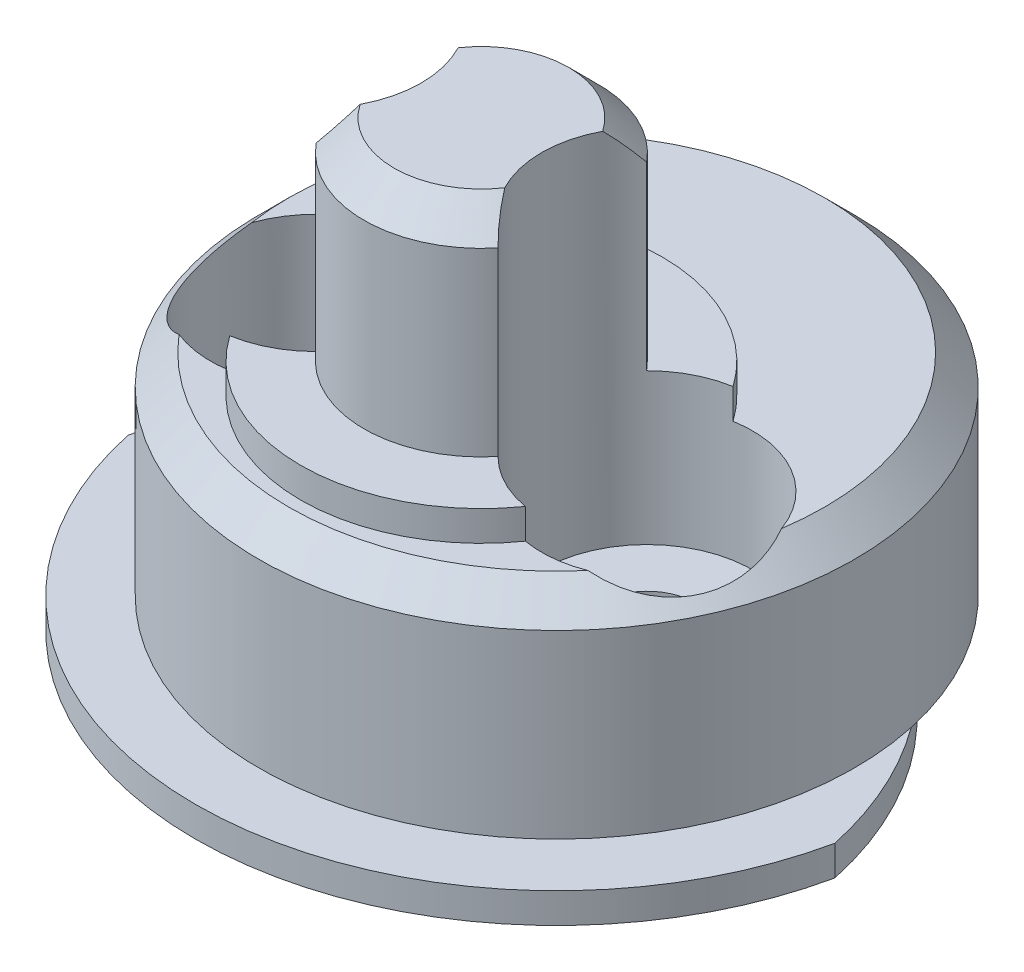
ISO-10303-21;
HEADER;
FILE_DESCRIPTION(('STEP AP214'),'2;1');
FILE_NAME('part.step','',(''),(''),'','','');
FILE_SCHEMA(('AUTOMOTIVE_DESIGN { 1 0 10303 214 1 1 1 1 }'));
ENDSEC;
DATA;
#1=APPLICATION_CONTEXT('core data for automotive mechanical design processes');
#2=APPLICATION_PROTOCOL_DEFINITION('international standard','automotive_design',2000,#1);
#3=PRODUCT_CONTEXT('',#1,'mechanical');
#4=PRODUCT('Part','Part','',(#3));
#5=PRODUCT_RELATED_PRODUCT_CATEGORY('part','',(#4));
#6=PRODUCT_DEFINITION_FORMATION('','',#4);
#7=PRODUCT_DEFINITION_CONTEXT('part definition',#1,'design');
#8=PRODUCT_DEFINITION('design','',#6,#7);
#9=PRODUCT_DEFINITION_SHAPE('','',#8);
#10=(LENGTH_UNIT() NAMED_UNIT(*) SI_UNIT(.MILLI.,.METRE.));
#11=(NAMED_UNIT(*) PLANE_ANGLE_UNIT() SI_UNIT($,.RADIAN.));
#12=(NAMED_UNIT(*) SI_UNIT($,.STERADIAN.) SOLID_ANGLE_UNIT());
#13=UNCERTAINTY_MEASURE_WITH_UNIT(LENGTH_MEASURE(1.E-05),#10,'distance_accuracy_value','');
#14=(GEOMETRIC_REPRESENTATION_CONTEXT(3) GLOBAL_UNCERTAINTY_ASSIGNED_CONTEXT((#13)) GLOBAL_UNIT_ASSIGNED_CONTEXT((#10,
#11,#12)) REPRESENTATION_CONTEXT('',''));
#15=CARTESIAN_POINT('',(0.,0.,0.));
#16=DIRECTION('',(0.,0.,1.));
#17=DIRECTION('',(1.,0.,0.));
#18=AXIS2_PLACEMENT_3D('',#15,#16,#17);
#19=CARTESIAN_POINT('',(0.,-1.,-2.5));
#20=DIRECTION('',(0.,-1.,0.));
#21=DIRECTION('',(0.,0.,-1.));
#22=AXIS2_PLACEMENT_3D('',#19,#20,#21);
#23=PLANE('',#22);
#24=CARTESIAN_POINT('',(5.5,-1.,0.));
#25=DIRECTION('',(0.,-1.,0.));
#26=DIRECTION('',(0.,0.,-1.));
#27=AXIS2_PLACEMENT_3D('',#24,#25,#26);
#28=CIRCLE('',#27,3.5);
#29=CARTESIAN_POINT('',(8.79964011547818,-1.,-1.16720825405201));
#30=VERTEX_POINT('',#29);
#31=CARTESIAN_POINT('',(4.90909090909091,-1.,-3.44975744745641));
#32=VERTEX_POINT('',#31);
#33=EDGE_CURVE('E146',#30,#32,#28,.F.);
#34=ORIENTED_EDGE('',*,*,#33,.F.);
#35=CARTESIAN_POINT('',(0.,-1.,-2.5));
#36=DIRECTION('',(0.,-1.,0.));
#37=DIRECTION('',(0.,0.,-1.));
#38=AXIS2_PLACEMENT_3D('',#35,#36,#37);
#39=CIRCLE('',#38,8.9);
#40=CARTESIAN_POINT('',(-8.79964011547818,-1.,-1.16720825405201));
#41=VERTEX_POINT('',#40);
#42=EDGE_CURVE('E11',#30,#41,#39,.F.);
#43=ORIENTED_EDGE('',*,*,#42,.T.);
#44=CARTESIAN_POINT('',(-5.5,-1.,0.));
#45=DIRECTION('',(0.,-1.,0.));
#46=DIRECTION('',(0.,0.,-1.));
#47=AXIS2_PLACEMENT_3D('',#44,#45,#46);
#48=CIRCLE('',#47,3.5);
#49=CARTESIAN_POINT('',(-4.90909090909091,-1.,-3.44975744745641));
#50=VERTEX_POINT('',#49);
#51=EDGE_CURVE('E172',#50,#41,#48,.F.);
#52=ORIENTED_EDGE('',*,*,#51,.F.);
#53=CARTESIAN_POINT('',(0.,-1.,0.));
#54=DIRECTION('',(0.,-1.,0.));
#55=DIRECTION('',(0.,0.,-1.));
#56=AXIS2_PLACEMENT_3D('',#53,#54,#55);
#57=CIRCLE('',#56,6.);
#58=EDGE_CURVE('E165',#50,#32,#57,.T.);
#59=ORIENTED_EDGE('',*,*,#58,.T.);
#60=EDGE_LOOP('',(#34,#43,#52,#59));
#61=FACE_BOUND('',#60,.T.);
#62=ADVANCED_FACE('F39',(#61),#23,.F.);
#63=CARTESIAN_POINT('',(0.,-1.,0.));
#64=DIRECTION('',(0.,1.,0.));
#65=DIRECTION('',(0.,0.,1.));
#66=AXIS2_PLACEMENT_3D('',#63,#64,#65);
#67=CYLINDRICAL_SURFACE('',#66,6.);
#68=DIRECTION('',(0.,-1.,0.));
#69=VECTOR('',#68,1.);
#70=CARTESIAN_POINT('',(-4.90909090909091,1.,-3.44975744745641));
#71=LINE('',#70,#69);
#72=CARTESIAN_POINT('',(-4.90909090909091,0.,-3.44975744745641));
#73=VERTEX_POINT('',#72);
#74=EDGE_CURVE('E276',#73,#50,#71,.T.);
#75=ORIENTED_EDGE('',*,*,#74,.F.);
#76=CARTESIAN_POINT('',(0.,0.,0.));
#77=DIRECTION('',(0.,-1.,0.));
#78=DIRECTION('',(0.,0.,-1.));
#79=AXIS2_PLACEMENT_3D('',#76,#77,#78);
#80=CIRCLE('',#79,6.);
#81=CARTESIAN_POINT('',(4.90909090909091,0.,-3.44975744745641));
#82=VERTEX_POINT('',#81);
#83=EDGE_CURVE('E167',#73,#82,#80,.T.);
#84=ORIENTED_EDGE('',*,*,#83,.T.);
#85=DIRECTION('',(0.,-1.,0.));
#86=VECTOR('',#85,1.);
#87=CARTESIAN_POINT('',(4.90909090909091,1.,-3.44975744745641));
#88=LINE('',#87,#86);
#89=EDGE_CURVE('E150',#32,#82,#88,.F.);
#90=ORIENTED_EDGE('',*,*,#89,.F.);
#91=ORIENTED_EDGE('',*,*,#58,.F.);
#92=EDGE_LOOP('',(#75,#84,#90,#91));
#93=FACE_BOUND('',#92,.T.);
#94=ADVANCED_FACE('F164',(#93),#67,.T.);
#95=CARTESIAN_POINT('',(0.,7.,0.));
#96=DIRECTION('',(0.,-1.,0.));
#97=DIRECTION('',(0.,0.,-1.));
#98=AXIS2_PLACEMENT_3D('',#95,#96,#97);
#99=CYLINDRICAL_SURFACE('',#98,3.9);
#100=DIRECTION('',(0.,-1.,0.));
#101=VECTOR('',#100,1.);
#102=CARTESIAN_POINT('',(-3.01909090909091,1.,-2.46882362323529));
#103=LINE('',#102,#101);
#104=CARTESIAN_POINT('',(-3.01909090909091,6.,-2.46882362323529));
#105=VERTEX_POINT('',#104);
#106=CARTESIAN_POINT('',(-3.01909090909091,0.,-2.46882362323529));
#107=VERTEX_POINT('',#106);
#108=EDGE_CURVE('E288',#105,#107,#103,.T.);
#109=ORIENTED_EDGE('',*,*,#108,.F.);
#110=CARTESIAN_POINT('',(0.,6.,0.));
#111=DIRECTION('',(0.,1.,0.));
#112=DIRECTION('',(0.,0.,1.));
#113=AXIS2_PLACEMENT_3D('',#110,#111,#112);
#114=CIRCLE('',#113,3.9);
#115=CARTESIAN_POINT('',(3.01909090909091,6.,-2.46882362323529));
#116=VERTEX_POINT('',#115);
#117=EDGE_CURVE('E260',#105,#116,#114,.F.);
#118=ORIENTED_EDGE('',*,*,#117,.T.);
#119=DIRECTION('',(0.,-1.,0.));
#120=VECTOR('',#119,1.);
#121=CARTESIAN_POINT('',(3.01909090909091,1.,-2.46882362323529));
#122=LINE('',#121,#120);
#123=CARTESIAN_POINT('',(3.01909090909091,0.,-2.46882362323529));
#124=VERTEX_POINT('',#123);
#125=EDGE_CURVE('E338',#124,#116,#122,.F.);
#126=ORIENTED_EDGE('',*,*,#125,.F.);
#127=CARTESIAN_POINT('',(0.,0.,0.));
#128=DIRECTION('',(0.,1.,0.));
#129=DIRECTION('',(0.,0.,1.));
#130=AXIS2_PLACEMENT_3D('',#127,#128,#129);
#131=CIRCLE('',#130,3.9);
#132=EDGE_CURVE('E186',#124,#107,#131,.T.);
#133=ORIENTED_EDGE('',*,*,#132,.T.);
#134=EDGE_LOOP('',(#109,#118,#126,#133));
#135=FACE_BOUND('',#134,.T.);
#136=ADVANCED_FACE('F248',(#135),#99,.T.);
#137=DIRECTION('',(0.,-1.,0.));
#138=VECTOR('',#137,1.);
#139=CARTESIAN_POINT('',(3.01909090909091,1.,2.46882362323529));
#140=LINE('',#139,#138);
#141=CARTESIAN_POINT('',(3.01909090909091,6.,2.46882362323529));
#142=VERTEX_POINT('',#141);
#143=CARTESIAN_POINT('',(3.01909090909091,0.,2.46882362323529));
#144=VERTEX_POINT('',#143);
#145=EDGE_CURVE('E342',#142,#144,#140,.T.);
#146=ORIENTED_EDGE('',*,*,#145,.F.);
#147=CARTESIAN_POINT('',(0.,6.,0.));
#148=DIRECTION('',(0.,1.,0.));
#149=DIRECTION('',(0.,0.,1.));
#150=AXIS2_PLACEMENT_3D('',#147,#148,#149);
#151=CIRCLE('',#150,3.9);
#152=CARTESIAN_POINT('',(-3.01909090909091,6.,2.46882362323529));
#153=VERTEX_POINT('',#152);
#154=EDGE_CURVE('E235',#142,#153,#151,.F.);
#155=ORIENTED_EDGE('',*,*,#154,.T.);
#156=DIRECTION('',(0.,-1.,0.));
#157=VECTOR('',#156,1.);
#158=CARTESIAN_POINT('',(-3.01909090909091,1.,2.46882362323529));
#159=LINE('',#158,#157);
#160=CARTESIAN_POINT('',(-3.01909090909091,0.,2.46882362323529));
#161=VERTEX_POINT('',#160);
#162=EDGE_CURVE('E281',#161,#153,#159,.F.);
#163=ORIENTED_EDGE('',*,*,#162,.F.);
#164=EDGE_CURVE('E177',#161,#144,#131,.T.);
#165=ORIENTED_EDGE('',*,*,#164,.T.);
#166=EDGE_LOOP('',(#146,#155,#163,#165));
#167=FACE_BOUND('',#166,.T.);
#168=ADVANCED_FACE('F526',(#167),#99,.T.);
#169=DIRECTION('',(0.,-1.,0.));
#170=VECTOR('',#169,1.);
#171=CARTESIAN_POINT('',(-4.90909090909091,1.,3.44975744745641));
#172=LINE('',#171,#170);
#173=CARTESIAN_POINT('',(-4.90909090909091,-1.,3.44975744745641));
#174=VERTEX_POINT('',#173);
#175=CARTESIAN_POINT('',(-4.90909090909091,0.,3.44975744745641));
#176=VERTEX_POINT('',#175);
#177=EDGE_CURVE('E283',#174,#176,#172,.F.);
#178=ORIENTED_EDGE('',*,*,#177,.F.);
#179=CARTESIAN_POINT('',(4.90909090909091,-1.,3.44975744745641));
#180=VERTEX_POINT('',#179);
#181=EDGE_CURVE('E173',#180,#174,#57,.T.);
#182=ORIENTED_EDGE('',*,*,#181,.F.);
#183=DIRECTION('',(0.,-1.,0.));
#184=VECTOR('',#183,1.);
#185=CARTESIAN_POINT('',(4.90909090909091,1.,3.44975744745641));
#186=LINE('',#185,#184);
#187=CARTESIAN_POINT('',(4.90909090909091,0.,3.44975744745641));
#188=VERTEX_POINT('',#187);
#189=EDGE_CURVE('E193',#188,#180,#186,.T.);
#190=ORIENTED_EDGE('',*,*,#189,.F.);
#191=EDGE_CURVE('E174',#188,#176,#80,.T.);
#192=ORIENTED_EDGE('',*,*,#191,.T.);
#193=EDGE_LOOP('',(#178,#182,#190,#192));
#194=FACE_BOUND('',#193,.T.);
#195=ADVANCED_FACE('F355',(#194),#67,.T.);
#196=CARTESIAN_POINT('',(-5.5,-9.,0.));
#197=DIRECTION('',(0.,1.,0.));
#198=DIRECTION('',(0.,0.,1.));
#199=AXIS2_PLACEMENT_3D('',#196,#197,#198);
#200=CYLINDRICAL_SURFACE('',#199,1.6);
#201=CARTESIAN_POINT('',(-5.5,-9.,0.));
#202=DIRECTION('',(0.,1.,0.));
#203=DIRECTION('',(0.,0.,1.));
#204=AXIS2_PLACEMENT_3D('',#201,#202,#203);
#205=CIRCLE('',#204,1.6);
#206=CARTESIAN_POINT('',(-5.5,-9.,1.6));
#207=VERTEX_POINT('',#206);
#208=EDGE_CURVE('E290',#207,#207,#205,.T.);
#209=ORIENTED_EDGE('',*,*,#208,.F.);
#210=EDGE_LOOP('',(#209));
#211=FACE_BOUND('',#210,.T.);
#212=CARTESIAN_POINT('',(-5.5,-5.,0.));
#213=DIRECTION('',(0.,1.,0.));
#214=DIRECTION('',(0.,0.,1.));
#215=AXIS2_PLACEMENT_3D('',#212,#213,#214);
#216=CIRCLE('',#215,1.6);
#217=CARTESIAN_POINT('',(-5.5,-5.,1.6));
#218=VERTEX_POINT('',#217);
#219=EDGE_CURVE('E190',#218,#218,#216,.F.);
#220=ORIENTED_EDGE('',*,*,#219,.F.);
#221=EDGE_LOOP('',(#220));
#222=FACE_BOUND('',#221,.T.);
#223=ADVANCED_FACE('F405',(#211,#222),#200,.F.);
#224=CARTESIAN_POINT('',(5.5,-9.,0.));
#225=DIRECTION('',(0.,1.,0.));
#226=DIRECTION('',(0.,0.,1.));
#227=AXIS2_PLACEMENT_3D('',#224,#225,#226);
#228=CYLINDRICAL_SURFACE('',#227,1.6);
#229=CARTESIAN_POINT('',(5.5,-9.,0.));
#230=DIRECTION('',(0.,1.,0.));
#231=DIRECTION('',(0.,0.,1.));
#232=AXIS2_PLACEMENT_3D('',#229,#230,#231);
#233=CIRCLE('',#232,1.6);
#234=CARTESIAN_POINT('',(5.5,-9.,1.6));
#235=VERTEX_POINT('',#234);
#236=EDGE_CURVE('E291',#235,#235,#233,.T.);
#237=ORIENTED_EDGE('',*,*,#236,.F.);
#238=EDGE_LOOP('',(#237));
#239=FACE_BOUND('',#238,.T.);
#240=CARTESIAN_POINT('',(5.5,-5.,0.));
#241=DIRECTION('',(0.,1.,0.));
#242=DIRECTION('',(0.,0.,1.));
#243=AXIS2_PLACEMENT_3D('',#240,#241,#242);
#244=CIRCLE('',#243,1.6);
#245=CARTESIAN_POINT('',(5.5,-5.,1.6));
#246=VERTEX_POINT('',#245);
#247=EDGE_CURVE('E187',#246,#246,#244,.F.);
#248=ORIENTED_EDGE('',*,*,#247,.F.);
#249=EDGE_LOOP('',(#248));
#250=FACE_BOUND('',#249,.T.);
#251=ADVANCED_FACE('F407',(#239,#250),#228,.F.);
#252=CARTESIAN_POINT('',(0.,0.,0.));
#253=DIRECTION('',(0.,-1.,0.));
#254=DIRECTION('',(0.,0.,-1.));
#255=AXIS2_PLACEMENT_3D('',#252,#253,#254);
#256=PLANE('',#255);
#257=CARTESIAN_POINT('',(-5.5,0.,0.));
#258=DIRECTION('',(0.,-1.,0.));
#259=DIRECTION('',(0.,0.,-1.));
#260=AXIS2_PLACEMENT_3D('',#257,#258,#259);
#261=CIRCLE('',#260,3.5);
#262=EDGE_CURVE('E279',#176,#161,#261,.F.);
#263=ORIENTED_EDGE('',*,*,#262,.F.);
#264=ORIENTED_EDGE('',*,*,#191,.F.);
#265=CARTESIAN_POINT('',(5.5,0.,0.));
#266=DIRECTION('',(0.,-1.,0.));
#267=DIRECTION('',(0.,0.,-1.));
#268=AXIS2_PLACEMENT_3D('',#265,#266,#267);
#269=CIRCLE('',#268,3.5);
#270=EDGE_CURVE('E169',#144,#188,#269,.F.);
#271=ORIENTED_EDGE('',*,*,#270,.F.);
#272=ORIENTED_EDGE('',*,*,#164,.F.);
#273=EDGE_LOOP('',(#263,#264,#271,#272));
#274=FACE_BOUND('',#273,.T.);
#275=ADVANCED_FACE('F353',(#274),#256,.F.);
#276=CARTESIAN_POINT('',(0.,7.,0.));
#277=DIRECTION('',(0.,1.,0.));
#278=DIRECTION('',(0.,0.,1.));
#279=AXIS2_PLACEMENT_3D('',#276,#277,#278);
#280=PLANE('',#279);
#281=CARTESIAN_POINT('',(-5.5,7.,0.));
#282=DIRECTION('',(0.,1.,0.));
#283=DIRECTION('',(0.,0.,1.));
#284=AXIS2_PLACEMENT_3D('',#281,#282,#283);
#285=CIRCLE('',#284,3.5);
#286=CARTESIAN_POINT('',(-2.40090909090909,7.,1.62654097310522));
#287=VERTEX_POINT('',#286);
#288=CARTESIAN_POINT('',(-2.40090909090909,7.,-1.62654097310522));
#289=VERTEX_POINT('',#288);
#290=EDGE_CURVE('E191',#287,#289,#285,.T.);
#291=ORIENTED_EDGE('',*,*,#290,.F.);
#292=CARTESIAN_POINT('',(0.,7.,0.));
#293=DIRECTION('',(0.,1.,0.));
#294=DIRECTION('',(0.,0.,1.));
#295=AXIS2_PLACEMENT_3D('',#292,#293,#294);
#296=CIRCLE('',#295,2.9);
#297=CARTESIAN_POINT('',(2.40090909090909,7.,1.62654097310522));
#298=VERTEX_POINT('',#297);
#299=EDGE_CURVE('E200',#287,#298,#296,.T.);
#300=ORIENTED_EDGE('',*,*,#299,.T.);
#301=CARTESIAN_POINT('',(5.5,7.,0.));
#302=DIRECTION('',(0.,1.,0.));
#303=DIRECTION('',(0.,0.,1.));
#304=AXIS2_PLACEMENT_3D('',#301,#302,#303);
#305=CIRCLE('',#304,3.5);
#306=CARTESIAN_POINT('',(2.40090909090909,7.,-1.62654097310522));
#307=VERTEX_POINT('',#306);
#308=EDGE_CURVE('E362',#307,#298,#305,.T.);
#309=ORIENTED_EDGE('',*,*,#308,.F.);
#310=CARTESIAN_POINT('',(0.,7.,0.));
#311=DIRECTION('',(0.,1.,0.));
#312=DIRECTION('',(0.,0.,1.));
#313=AXIS2_PLACEMENT_3D('',#310,#311,#312);
#314=CIRCLE('',#313,2.9);
#315=EDGE_CURVE('E197',#307,#289,#314,.T.);
#316=ORIENTED_EDGE('',*,*,#315,.T.);
#317=EDGE_LOOP('',(#291,#300,#309,#316));
#318=FACE_BOUND('',#317,.T.);
#319=ADVANCED_FACE('F414',(#318),#280,.T.);
#320=CARTESIAN_POINT('',(-5.5,0.,0.));
#321=DIRECTION('',(0.,-1.,0.));
#322=DIRECTION('',(0.,0.,-1.));
#323=AXIS2_PLACEMENT_3D('',#320,#321,#322);
#324=CIRCLE('',#323,3.5);
#325=EDGE_CURVE('E278',#107,#73,#324,.F.);
#326=ORIENTED_EDGE('',*,*,#325,.F.);
#327=ORIENTED_EDGE('',*,*,#132,.F.);
#328=CARTESIAN_POINT('',(5.5,0.,0.));
#329=DIRECTION('',(0.,-1.,0.));
#330=DIRECTION('',(0.,0.,-1.));
#331=AXIS2_PLACEMENT_3D('',#328,#329,#330);
#332=CIRCLE('',#331,3.5);
#333=EDGE_CURVE('E168',#82,#124,#332,.F.);
#334=ORIENTED_EDGE('',*,*,#333,.F.);
#335=ORIENTED_EDGE('',*,*,#83,.F.);
#336=EDGE_LOOP('',(#326,#327,#334,#335));
#337=FACE_BOUND('',#336,.T.);
#338=ADVANCED_FACE('F340',(#337),#256,.F.);
#339=CARTESIAN_POINT('',(0.,-8.,-2.5));
#340=DIRECTION('',(0.,1.,0.));
#341=DIRECTION('',(0.,0.,1.));
#342=AXIS2_PLACEMENT_3D('',#339,#340,#341);
#343=CYLINDRICAL_SURFACE('',#342,9.9);
#344=CARTESIAN_POINT('',(0.,-2.,-2.5));
#345=DIRECTION('',(0.,-1.,0.));
#346=DIRECTION('',(0.,0.,-1.));
#347=AXIS2_PLACEMENT_3D('',#344,#345,#346);
#348=CIRCLE('',#347,9.9);
#349=CARTESIAN_POINT('',(0.,-2.,-12.4));
#350=VERTEX_POINT('',#349);
#351=EDGE_CURVE('E267',#350,#350,#348,.T.);
#352=ORIENTED_EDGE('',*,*,#351,.T.);
#353=EDGE_LOOP('',(#352));
#354=FACE_BOUND('',#353,.T.);
#355=CARTESIAN_POINT('',(0.,-8.,-2.5));
#356=DIRECTION('',(0.,-1.,0.));
#357=DIRECTION('',(0.,0.,-1.));
#358=AXIS2_PLACEMENT_3D('',#355,#356,#357);
#359=CIRCLE('',#358,9.9);
#360=CARTESIAN_POINT('',(9.67492630462889,-8.,-4.599));
#361=VERTEX_POINT('',#360);
#362=CARTESIAN_POINT('',(-9.67492630462889,-8.,-4.599));
#363=VERTEX_POINT('',#362);
#364=EDGE_CURVE('E181',#361,#363,#359,.T.);
#365=ORIENTED_EDGE('',*,*,#364,.F.);
#366=EDGE_CURVE('E311',#363,#361,#359,.T.);
#367=ORIENTED_EDGE('',*,*,#366,.F.);
#368=EDGE_LOOP('',(#365,#367));
#369=FACE_BOUND('',#368,.T.);
#370=ADVANCED_FACE('F392',(#354,#369),#343,.T.);
#371=CARTESIAN_POINT('',(0.,-8.,-2.5));
#372=DIRECTION('',(0.,-1.,0.));
#373=DIRECTION('',(0.,0.,-1.));
#374=AXIS2_PLACEMENT_3D('',#371,#372,#373);
#375=PLANE('',#374);
#376=CARTESIAN_POINT('',(0.,-8.,2.5));
#377=DIRECTION('',(0.,-1.,0.));
#378=DIRECTION('',(0.,0.,-1.));
#379=AXIS2_PLACEMENT_3D('',#376,#377,#378);
#380=CIRCLE('',#379,12.);
#381=EDGE_CURVE('E158',#363,#361,#380,.T.);
#382=ORIENTED_EDGE('',*,*,#381,.F.);
#383=ORIENTED_EDGE('',*,*,#366,.T.);
#384=EDGE_LOOP('',(#382,#383));
#385=FACE_BOUND('',#384,.T.);
#386=ADVANCED_FACE('F386',(#385),#375,.T.);
#387=CARTESIAN_POINT('',(-6.79022289822044,-1.,3.25350962391502));
#388=VERTEX_POINT('',#387);
#389=EDGE_CURVE('E195',#388,#174,#48,.F.);
#390=ORIENTED_EDGE('',*,*,#389,.F.);
#391=CARTESIAN_POINT('',(0.,-1.,-2.5));
#392=DIRECTION('',(0.,-1.,0.));
#393=DIRECTION('',(0.,0.,-1.));
#394=AXIS2_PLACEMENT_3D('',#391,#392,#393);
#395=CIRCLE('',#394,8.9);
#396=CARTESIAN_POINT('',(6.79022289822044,-1.,3.25350962391502));
#397=VERTEX_POINT('',#396);
#398=EDGE_CURVE('E49',#388,#397,#395,.F.);
#399=ORIENTED_EDGE('',*,*,#398,.T.);
#400=EDGE_CURVE('E157',#180,#397,#28,.F.);
#401=ORIENTED_EDGE('',*,*,#400,.F.);
#402=ORIENTED_EDGE('',*,*,#181,.T.);
#403=EDGE_LOOP('',(#390,#399,#401,#402));
#404=FACE_BOUND('',#403,.T.);
#405=ADVANCED_FACE('F271',(#404),#23,.F.);
#406=CARTESIAN_POINT('',(0.,-8.,0.));
#407=DIRECTION('',(0.,-1.,0.));
#408=DIRECTION('',(0.,0.,-1.));
#409=AXIS2_PLACEMENT_3D('',#406,#407,#408);
#410=PLANE('',#409);
#411=CARTESIAN_POINT('',(11.7366945943055,-8.,0.));
#412=VERTEX_POINT('',#411);
#413=EDGE_CURVE('E294',#361,#412,#380,.T.);
#414=ORIENTED_EDGE('',*,*,#413,.F.);
#415=ORIENTED_EDGE('',*,*,#364,.T.);
#416=CARTESIAN_POINT('',(-11.7366945943055,-8.,0.));
#417=VERTEX_POINT('',#416);
#418=EDGE_CURVE('E304',#417,#363,#380,.T.);
#419=ORIENTED_EDGE('',*,*,#418,.F.);
#420=CARTESIAN_POINT('',(0.,-8.,-2.5));
#421=DIRECTION('',(0.,-1.,0.));
#422=DIRECTION('',(0.,0.,-1.));
#423=AXIS2_PLACEMENT_3D('',#420,#421,#422);
#424=CIRCLE('',#423,12.);
#425=EDGE_CURVE('E301',#412,#417,#424,.T.);
#426=ORIENTED_EDGE('',*,*,#425,.F.);
#427=EDGE_LOOP('',(#414,#415,#419,#426));
#428=FACE_BOUND('',#427,.T.);
#429=ADVANCED_FACE('F321',(#428),#410,.F.);
#430=CARTESIAN_POINT('',(0.,-9.,2.5));
#431=DIRECTION('',(0.,1.,0.));
#432=DIRECTION('',(0.,0.,1.));
#433=AXIS2_PLACEMENT_3D('',#430,#431,#432);
#434=CYLINDRICAL_SURFACE('',#433,12.);
#435=ORIENTED_EDGE('',*,*,#418,.T.);
#436=ORIENTED_EDGE('',*,*,#381,.T.);
#437=ORIENTED_EDGE('',*,*,#413,.T.);
#438=DIRECTION('',(0.,1.,0.));
#439=VECTOR('',#438,1.);
#440=CARTESIAN_POINT('',(11.7366945943055,-9.,0.));
#441=LINE('',#440,#439);
#442=CARTESIAN_POINT('',(11.7366945943055,-9.,0.));
#443=VERTEX_POINT('',#442);
#444=EDGE_CURVE('E309',#443,#412,#441,.T.);
#445=ORIENTED_EDGE('',*,*,#444,.F.);
#446=CARTESIAN_POINT('',(0.,-9.,2.5));
#447=DIRECTION('',(0.,-1.,0.));
#448=DIRECTION('',(0.,0.,-1.));
#449=AXIS2_PLACEMENT_3D('',#446,#447,#448);
#450=CIRCLE('',#449,12.);
#451=CARTESIAN_POINT('',(-11.7366945943055,-9.,0.));
#452=VERTEX_POINT('',#451);
#453=EDGE_CURVE('E297',#452,#443,#450,.T.);
#454=ORIENTED_EDGE('',*,*,#453,.F.);
#455=DIRECTION('',(0.,1.,0.));
#456=VECTOR('',#455,1.);
#457=CARTESIAN_POINT('',(-11.7366945943055,-9.,0.));
#458=LINE('',#457,#456);
#459=EDGE_CURVE('E303',#452,#417,#458,.T.);
#460=ORIENTED_EDGE('',*,*,#459,.T.);
#461=EDGE_LOOP('',(#435,#436,#437,#445,#454,#460));
#462=FACE_BOUND('',#461,.T.);
#463=ADVANCED_FACE('F326',(#462),#434,.T.);
#464=CARTESIAN_POINT('',(0.,-9.,-2.5));
#465=DIRECTION('',(0.,1.,0.));
#466=DIRECTION('',(0.,0.,1.));
#467=AXIS2_PLACEMENT_3D('',#464,#465,#466);
#468=CYLINDRICAL_SURFACE('',#467,12.);
#469=ORIENTED_EDGE('',*,*,#425,.T.);
#470=ORIENTED_EDGE('',*,*,#459,.F.);
#471=CARTESIAN_POINT('',(0.,-9.,-2.5));
#472=DIRECTION('',(0.,-1.,0.));
#473=DIRECTION('',(0.,0.,-1.));
#474=AXIS2_PLACEMENT_3D('',#471,#472,#473);
#475=CIRCLE('',#474,12.);
#476=EDGE_CURVE('E300',#443,#452,#475,.T.);
#477=ORIENTED_EDGE('',*,*,#476,.F.);
#478=ORIENTED_EDGE('',*,*,#444,.T.);
#479=EDGE_LOOP('',(#469,#470,#477,#478));
#480=FACE_BOUND('',#479,.T.);
#481=ADVANCED_FACE('F329',(#480),#468,.T.);
#482=CARTESIAN_POINT('',(0.,-9.,0.));
#483=DIRECTION('',(0.,-1.,0.));
#484=DIRECTION('',(0.,0.,-1.));
#485=AXIS2_PLACEMENT_3D('',#482,#483,#484);
#486=PLANE('',#485);
#487=ORIENTED_EDGE('',*,*,#236,.T.);
#488=EDGE_LOOP('',(#487));
#489=FACE_BOUND('',#488,.T.);
#490=ORIENTED_EDGE('',*,*,#208,.T.);
#491=EDGE_LOOP('',(#490));
#492=FACE_BOUND('',#491,.T.);
#493=ORIENTED_EDGE('',*,*,#453,.T.);
#494=ORIENTED_EDGE('',*,*,#476,.T.);
#495=EDGE_LOOP('',(#493,#494));
#496=FACE_BOUND('',#495,.T.);
#497=ADVANCED_FACE('F220',(#489,#492,#496),#486,.T.);
#498=CARTESIAN_POINT('',(5.5,7.,0.));
#499=DIRECTION('',(0.,-1.,0.));
#500=DIRECTION('',(0.,0.,-1.));
#501=AXIS2_PLACEMENT_3D('',#498,#499,#500);
#502=CYLINDRICAL_SURFACE('',#501,3.5);
#503=CARTESIAN_POINT('',(5.5,-5.,0.));
#504=DIRECTION('',(0.,1.,0.));
#505=DIRECTION('',(0.,0.,1.));
#506=AXIS2_PLACEMENT_3D('',#503,#504,#505);
#507=CIRCLE('',#506,3.5);
#508=CARTESIAN_POINT('',(5.5,-5.,3.5));
#509=VERTEX_POINT('',#508);
#510=EDGE_CURVE('E358',#509,#509,#507,.T.);
#511=ORIENTED_EDGE('',*,*,#510,.F.);
#512=EDGE_LOOP('',(#511));
#513=FACE_BOUND('',#512,.T.);
#514=ORIENTED_EDGE('',*,*,#308,.T.);
#515=CARTESIAN_POINT('',(2.40090909090909,7.,1.62654097310523));
#516=CARTESIAN_POINT('',(2.42199990388801,6.95999725035649,1.66672069154054));
#517=CARTESIAN_POINT('',(2.44371788101233,6.9196387331948,1.70620680259726));
#518=CARTESIAN_POINT('',(2.48837645371307,6.83833550017322,1.78385348886781));
#519=CARTESIAN_POINT('',(2.51131692743927,6.79739084303224,1.82201419556508));
#520=CARTESIAN_POINT('',(2.58178012938787,6.67411755196546,1.93437187306167));
#521=CARTESIAN_POINT('',(2.63108023452129,6.59109161468316,2.0067010878354));
#522=CARTESIAN_POINT('',(2.73420776146176,6.42390021197347,2.14661332732124));
#523=CARTESIAN_POINT('',(2.78803472806847,6.33973486183259,2.21419682798942));
#524=CARTESIAN_POINT('',(2.90022605056246,6.17042718120971,2.34490684909427));
#525=CARTESIAN_POINT('',(2.95860411664017,6.08528261354037,2.40801871582163));
#526=CARTESIAN_POINT('',(3.01909090909091,6.00000000000001,2.4688236232353));
#527=B_SPLINE_CURVE_WITH_KNOTS('',3,(#515,#516,#517,#518,#519,#520,#521,#522,#523,#524,#525,
#526),.UNSPECIFIED.,.F.,.F.,(4,2,2,2,2,4),(0.,0.181460361517043,0.362902669994912,
0.724624119957299,1.08630924026815,1.44912949206952),.UNSPECIFIED.);
#528=EDGE_CURVE('E228',#298,#142,#527,.T.);
#529=ORIENTED_EDGE('',*,*,#528,.T.);
#530=ORIENTED_EDGE('',*,*,#145,.T.);
#531=ORIENTED_EDGE('',*,*,#270,.T.);
#532=ORIENTED_EDGE('',*,*,#189,.T.);
#533=ORIENTED_EDGE('',*,*,#400,.T.);
#534=CARTESIAN_POINT('',(6.79022289822044,-1.,3.25350962391502));
#535=CARTESIAN_POINT('',(6.86966342894281,-1.0402457586237,3.22201362429472));
#536=CARTESIAN_POINT('',(6.94861048957112,-1.07901752787151,3.18733136238277));
#537=CARTESIAN_POINT('',(7.10496625843925,-1.15337869777628,3.11153115674559));
#538=CARTESIAN_POINT('',(7.18237395939578,-1.18896606476426,3.07040914582352));
#539=CARTESIAN_POINT('',(7.33532230518292,-1.25681651115793,2.98151724979297));
#540=CARTESIAN_POINT('',(7.41085359490683,-1.28906478803481,2.9337197992728));
#541=CARTESIAN_POINT('',(7.55899848002116,-1.34978346570966,2.83171812834672));
#542=CARTESIAN_POINT('',(7.63161264729381,-1.37825460953385,2.77751517199114));
#543=CARTESIAN_POINT('',(7.84465856933906,-1.45783146961186,2.60498621688847));
#544=CARTESIAN_POINT('',(7.97980281129003,-1.50288318505745,2.47702147406228));
#545=CARTESIAN_POINT('',(8.22965883278394,-1.5747344949486,2.19860784449164));
#546=CARTESIAN_POINT('',(8.34441627865589,-1.60157527228201,2.04821063405966));
#547=CARTESIAN_POINT('',(8.54064862013234,-1.63455497771984,1.74207180300463));
#548=CARTESIAN_POINT('',(8.62405609649435,-1.64218314656135,1.58772903047237));
#549=CARTESIAN_POINT('',(8.76680450402185,-1.64077316769958,1.26829981743287));
#550=CARTESIAN_POINT('',(8.82613998706493,-1.63173124968365,1.10321095460411));
#551=CARTESIAN_POINT('',(8.91701498192721,-1.59817962397532,0.77559873195805));
#552=CARTESIAN_POINT('',(8.94973412093945,-1.57442002762373,0.613321982418135));
#553=CARTESIAN_POINT('',(8.99194471529335,-1.51298614950457,0.288395788306735));
#554=CARTESIAN_POINT('',(9.00143083389243,-1.4753086730163,0.12574626669417));
#555=CARTESIAN_POINT('',(8.99815321370098,-1.38547486205018,-0.202347242629634));
#556=CARTESIAN_POINT('',(8.98446609944584,-1.33279061346917,-0.367634587070396));
#557=CARTESIAN_POINT('',(8.93514097699868,-1.21531273920601,-0.690211317736818));
#558=CARTESIAN_POINT('',(8.8995244334156,-1.15053099774168,-0.847508362124047));
#559=CARTESIAN_POINT('',(8.83738935793464,-1.05440852715114,-1.0561078163307));
#560=CARTESIAN_POINT('',(8.81915086097426,-1.02754447445046,-1.1120754830298));
#561=CARTESIAN_POINT('',(8.79964011547818,-1.,-1.16720825405201));
#562=B_SPLINE_CURVE_WITH_KNOTS('',3,(#534,#535,#536,#537,#538,#539,#540,#541,#542,#543,#544,
#545,#546,#547,#548,#549,#550,#551,#552,#553,#554,#555,#556,#557,#558,#559,#560,#561),
.UNSPECIFIED.,.F.,.F.,(4,2,2,2,2,2,2,2,2,2,2,2,2,4),(0.,0.283338258744689,0.56685619452006,
0.851581544540817,1.13625080093406,1.70738405036864,2.27722137416255,2.8013023603098,
3.32550189362439,3.82496281507743,4.3245384544807,4.84449223009244,5.36393788025238,
5.55794548312024),.UNSPECIFIED.);
#563=EDGE_CURVE('E154',#397,#30,#562,.T.);
#564=ORIENTED_EDGE('',*,*,#563,.T.);
#565=ORIENTED_EDGE('',*,*,#33,.T.);
#566=ORIENTED_EDGE('',*,*,#89,.T.);
#567=ORIENTED_EDGE('',*,*,#333,.T.);
#568=ORIENTED_EDGE('',*,*,#125,.T.);
#569=CARTESIAN_POINT('',(3.01909090909091,6.,-2.46882362323529));
#570=CARTESIAN_POINT('',(2.95860411664017,6.08528261354037,-2.40801871582163));
#571=CARTESIAN_POINT('',(2.90022605056247,6.17042718120971,-2.34490684909428));
#572=CARTESIAN_POINT('',(2.78803472806847,6.33973486183258,-2.21419682798942));
#573=CARTESIAN_POINT('',(2.73420776146176,6.42390021197346,-2.14661332732124));
#574=CARTESIAN_POINT('',(2.6310802345213,6.59109161468316,-2.00670108783541));
#575=CARTESIAN_POINT('',(2.58178012938787,6.67411755196547,-1.93437187306168));
#576=CARTESIAN_POINT('',(2.51131692743927,6.79739084303223,-1.82201419556509));
#577=CARTESIAN_POINT('',(2.48837645371307,6.8383355001732,-1.78385348886781));
#578=CARTESIAN_POINT('',(2.44371788101233,6.9196387331948,-1.70620680259728));
#579=CARTESIAN_POINT('',(2.42199990388802,6.95999725035652,-1.66672069154059));
#580=CARTESIAN_POINT('',(2.4009090909091,7.0000000000001,-1.62654097310535));
#581=B_SPLINE_CURVE_WITH_KNOTS('',3,(#569,#570,#571,#572,#573,#574,#575,#576,#577,#578,#579,
#580),.UNSPECIFIED.,.F.,.F.,(4,2,2,2,2,4),(0.,0.362820251801365,0.724505372112218,
1.0862268220746,1.26766913055246,1.4491294920695),.UNSPECIFIED.);
#582=EDGE_CURVE('E209',#116,#307,#581,.T.);
#583=ORIENTED_EDGE('',*,*,#582,.T.);
#584=EDGE_LOOP('',(#514,#529,#530,#531,#532,#533,#564,#565,#566,#567,#568,#583));
#585=FACE_BOUND('',#584,.T.);
#586=ADVANCED_FACE('F149',(#513,#585),#502,.F.);
#587=CARTESIAN_POINT('',(5.5,-5.,0.));
#588=DIRECTION('',(0.,1.,0.));
#589=DIRECTION('',(0.,0.,1.));
#590=AXIS2_PLACEMENT_3D('',#587,#588,#589);
#591=PLANE('',#590);
#592=ORIENTED_EDGE('',*,*,#510,.T.);
#593=EDGE_LOOP('',(#592));
#594=FACE_BOUND('',#593,.T.);
#595=ORIENTED_EDGE('',*,*,#247,.T.);
#596=EDGE_LOOP('',(#595));
#597=FACE_BOUND('',#596,.T.);
#598=ADVANCED_FACE('F219',(#594,#597),#591,.T.);
#599=CARTESIAN_POINT('',(-5.5,7.,0.));
#600=DIRECTION('',(0.,-1.,0.));
#601=DIRECTION('',(0.,0.,-1.));
#602=AXIS2_PLACEMENT_3D('',#599,#600,#601);
#603=CYLINDRICAL_SURFACE('',#602,3.5);
#604=CARTESIAN_POINT('',(-5.5,-5.,0.));
#605=DIRECTION('',(0.,1.,0.));
#606=DIRECTION('',(0.,0.,1.));
#607=AXIS2_PLACEMENT_3D('',#604,#605,#606);
#608=CIRCLE('',#607,3.5);
#609=CARTESIAN_POINT('',(-5.5,-5.,3.5));
#610=VERTEX_POINT('',#609);
#611=EDGE_CURVE('E361',#610,#610,#608,.T.);
#612=ORIENTED_EDGE('',*,*,#611,.F.);
#613=EDGE_LOOP('',(#612));
#614=FACE_BOUND('',#613,.T.);
#615=ORIENTED_EDGE('',*,*,#162,.T.);
#616=CARTESIAN_POINT('',(-3.01909090909091,6.,2.46882362323529));
#617=CARTESIAN_POINT('',(-2.95860411664017,6.08528261354037,2.40801871582163));
#618=CARTESIAN_POINT('',(-2.90022605056247,6.17042718120971,2.34490684909428));
#619=CARTESIAN_POINT('',(-2.78803472806847,6.33973486183258,2.21419682798942));
#620=CARTESIAN_POINT('',(-2.73420776146176,6.42390021197346,2.14661332732124));
#621=CARTESIAN_POINT('',(-2.6310802345213,6.59109161468316,2.00670108783541));
#622=CARTESIAN_POINT('',(-2.58178012938787,6.67411755196547,1.93437187306168));
#623=CARTESIAN_POINT('',(-2.51131692743927,6.79739084303223,1.82201419556509));
#624=CARTESIAN_POINT('',(-2.48837645371307,6.8383355001732,1.78385348886781));
#625=CARTESIAN_POINT('',(-2.44371788101233,6.9196387331948,1.70620680259728));
#626=CARTESIAN_POINT('',(-2.42199990388802,6.95999725035652,1.66672069154059));
#627=CARTESIAN_POINT('',(-2.4009090909091,7.0000000000001,1.62654097310535));
#628=B_SPLINE_CURVE_WITH_KNOTS('',3,(#616,#617,#618,#619,#620,#621,#622,#623,#624,#625,#626,
#627),.UNSPECIFIED.,.F.,.F.,(4,2,2,2,2,4),(0.,0.362820251801365,0.724505372112218,
1.0862268220746,1.26766913055246,1.4491294920695),.UNSPECIFIED.);
#629=EDGE_CURVE('E253',#153,#287,#628,.T.);
#630=ORIENTED_EDGE('',*,*,#629,.T.);
#631=ORIENTED_EDGE('',*,*,#290,.T.);
#632=CARTESIAN_POINT('',(-2.40090909090909,7.,-1.62654097310523));
#633=CARTESIAN_POINT('',(-2.42199990388801,6.95999725035649,-1.66672069154054));
#634=CARTESIAN_POINT('',(-2.44371788101233,6.9196387331948,-1.70620680259726));
#635=CARTESIAN_POINT('',(-2.48837645371307,6.83833550017322,-1.78385348886781));
#636=CARTESIAN_POINT('',(-2.51131692743927,6.79739084303224,-1.82201419556508));
#637=CARTESIAN_POINT('',(-2.58178012938787,6.67411755196546,-1.93437187306167));
#638=CARTESIAN_POINT('',(-2.63108023452129,6.59109161468316,-2.0067010878354));
#639=CARTESIAN_POINT('',(-2.73420776146176,6.42390021197347,-2.14661332732124));
#640=CARTESIAN_POINT('',(-2.78803472806847,6.33973486183259,-2.21419682798942));
#641=CARTESIAN_POINT('',(-2.90022605056246,6.17042718120971,-2.34490684909427));
#642=CARTESIAN_POINT('',(-2.95860411664017,6.08528261354037,-2.40801871582163));
#643=CARTESIAN_POINT('',(-3.01909090909091,6.00000000000001,-2.4688236232353));
#644=B_SPLINE_CURVE_WITH_KNOTS('',3,(#632,#633,#634,#635,#636,#637,#638,#639,#640,#641,#642,
#643),.UNSPECIFIED.,.F.,.F.,(4,2,2,2,2,4),(0.,0.181460361517043,0.362902669994912,
0.724624119957299,1.08630924026815,1.44912949206952),.UNSPECIFIED.);
#645=EDGE_CURVE('E261',#289,#105,#644,.T.);
#646=ORIENTED_EDGE('',*,*,#645,.T.);
#647=ORIENTED_EDGE('',*,*,#108,.T.);
#648=ORIENTED_EDGE('',*,*,#325,.T.);
#649=ORIENTED_EDGE('',*,*,#74,.T.);
#650=ORIENTED_EDGE('',*,*,#51,.T.);
#651=CARTESIAN_POINT('',(-8.79964011547818,-1.,-1.16720825405201));
#652=CARTESIAN_POINT('',(-8.82814512226664,-1.0402457586237,-1.0866461010177));
#653=CARTESIAN_POINT('',(-8.85392504699268,-1.07901752787151,-1.00436066394468));
#654=CARTESIAN_POINT('',(-8.89962457569987,-1.15337869777628,-0.836717141227803));
#655=CARTESIAN_POINT('',(-8.91954045303138,-1.18896606476426,-0.75135714017481));
#656=CARTESIAN_POINT('',(-8.95313588201909,-1.25681651115793,-0.577672619246603));
#657=CARTESIAN_POINT('',(-8.96678851391139,-1.28906478803481,-0.489337022537246));
#658=CARTESIAN_POINT('',(-8.98734827534363,-1.34978346570966,-0.310651421362719));
#659=CARTESIAN_POINT('',(-8.99425673328241,-1.37825460953385,-0.220301817183765));
#660=CARTESIAN_POINT('',(-9.0043541542074,-1.45783146961186,0.0536559301781058));
#661=CARTESIAN_POINT('',(-8.99680432897736,-1.50288318505745,0.239618135150169));
#662=CARTESIAN_POINT('',(-8.95132952631053,-1.5747344949486,0.610932318733125));
#663=CARTESIAN_POINT('',(-8.91347351025704,-1.60157527228201,0.796284724537127));
#664=CARTESIAN_POINT('',(-8.81185045111791,-1.63455497771984,1.14542777483639));
#665=CARTESIAN_POINT('',(-8.75040807270835,-1.64218314656135,1.30975468280158));
#666=CARTESIAN_POINT('',(-8.60360419386105,-1.64077316769958,1.62734049978663));
#667=CARTESIAN_POINT('',(-8.51823728605949,-1.63173124968365,1.78059689681608));
#668=CARTESIAN_POINT('',(-8.33115958068766,-1.59817962397532,2.06448061468507));
#669=CARTESIAN_POINT('',(-8.23041023065878,-1.57442002762373,2.1958345410356));
#670=CARTESIAN_POINT('',(-8.01335773549248,-1.51298614950457,2.44128714386864));
#671=CARTESIAN_POINT('',(-7.8970510232194,-1.4753086730163,2.55538185017484));
#672=CARTESIAN_POINT('',(-7.64770213579476,-1.38547486205018,2.76864512876406));
#673=CARTESIAN_POINT('',(-7.51417082855518,-1.33279061346917,2.86701500888904));
#674=CARTESIAN_POINT('',(-7.23870060849879,-1.21531273920601,3.04195749296294));
#675=CARTESIAN_POINT('',(-7.09677003954968,-1.15053099774168,3.11855130438099));
#676=CARTESIAN_POINT('',(-6.89875012715992,-1.05440852715114,3.20889849137368));
#677=CARTESIAN_POINT('',(-6.84459027068664,-1.02754447445046,3.23195781560294));
#678=CARTESIAN_POINT('',(-6.79022289822044,-1.,3.25350962391502));
#679=B_SPLINE_CURVE_WITH_KNOTS('',3,(#651,#652,#653,#654,#655,#656,#657,#658,#659,#660,#661,
#662,#663,#664,#665,#666,#667,#668,#669,#670,#671,#672,#673,#674,#675,#676,#677,#678),
.UNSPECIFIED.,.F.,.F.,(4,2,2,2,2,2,2,2,2,2,2,2,2,4),(0.,0.283338258744688,0.56685619452006,
0.851581544540817,1.13625080093406,1.70738405036864,2.27722137416255,2.80130236030979,
3.32550189362439,3.82496281507743,4.3245384544807,4.84449223009244,5.36393788025238,
5.55794548312024),.UNSPECIFIED.);
#680=EDGE_CURVE('E56',#41,#388,#679,.T.);
#681=ORIENTED_EDGE('',*,*,#680,.T.);
#682=ORIENTED_EDGE('',*,*,#389,.T.);
#683=ORIENTED_EDGE('',*,*,#177,.T.);
#684=ORIENTED_EDGE('',*,*,#262,.T.);
#685=EDGE_LOOP('',(#615,#630,#631,#646,#647,#648,#649,#650,#681,#682,#683,#684));
#686=FACE_BOUND('',#685,.T.);
#687=ADVANCED_FACE('F222',(#614,#686),#603,.F.);
#688=CARTESIAN_POINT('',(-5.5,-5.,0.));
#689=DIRECTION('',(0.,1.,0.));
#690=DIRECTION('',(0.,0.,1.));
#691=AXIS2_PLACEMENT_3D('',#688,#689,#690);
#692=PLANE('',#691);
#693=ORIENTED_EDGE('',*,*,#611,.T.);
#694=EDGE_LOOP('',(#693));
#695=FACE_BOUND('',#694,.T.);
#696=ORIENTED_EDGE('',*,*,#219,.T.);
#697=EDGE_LOOP('',(#696));
#698=FACE_BOUND('',#697,.T.);
#699=ADVANCED_FACE('F246',(#695,#698),#692,.T.);
#700=CARTESIAN_POINT('',(0.,7.,0.));
#701=DIRECTION('',(0.,-1.,0.));
#702=DIRECTION('',(0.,0.,-1.));
#703=AXIS2_PLACEMENT_3D('',#700,#701,#702);
#704=CONICAL_SURFACE('',#703,2.9,0.785398163397445);
#705=ORIENTED_EDGE('',*,*,#629,.F.);
#706=ORIENTED_EDGE('',*,*,#154,.F.);
#707=ORIENTED_EDGE('',*,*,#528,.F.);
#708=ORIENTED_EDGE('',*,*,#299,.F.);
#709=EDGE_LOOP('',(#705,#706,#707,#708));
#710=FACE_BOUND('',#709,.T.);
#711=ADVANCED_FACE('F238',(#710),#704,.T.);
#712=CARTESIAN_POINT('',(0.,7.,0.));
#713=DIRECTION('',(0.,-1.,0.));
#714=DIRECTION('',(0.,0.,-1.));
#715=AXIS2_PLACEMENT_3D('',#712,#713,#714);
#716=CONICAL_SURFACE('',#715,2.9,0.785398163397445);
#717=ORIENTED_EDGE('',*,*,#582,.F.);
#718=ORIENTED_EDGE('',*,*,#117,.F.);
#719=ORIENTED_EDGE('',*,*,#645,.F.);
#720=ORIENTED_EDGE('',*,*,#315,.F.);
#721=EDGE_LOOP('',(#717,#718,#719,#720));
#722=FACE_BOUND('',#721,.T.);
#723=ADVANCED_FACE('F245',(#722),#716,.T.);
#724=CARTESIAN_POINT('',(0.,-2.,-2.5));
#725=DIRECTION('',(0.,-1.,0.));
#726=DIRECTION('',(0.,0.,-1.));
#727=AXIS2_PLACEMENT_3D('',#724,#725,#726);
#728=CONICAL_SURFACE('',#727,9.9,0.785398163397449);
#729=ORIENTED_EDGE('',*,*,#680,.F.);
#730=ORIENTED_EDGE('',*,*,#42,.F.);
#731=ORIENTED_EDGE('',*,*,#563,.F.);
#732=ORIENTED_EDGE('',*,*,#398,.F.);
#733=EDGE_LOOP('',(#729,#730,#731,#732));
#734=FACE_BOUND('',#733,.T.);
#735=ORIENTED_EDGE('',*,*,#351,.F.);
#736=EDGE_LOOP('',(#735));
#737=FACE_BOUND('',#736,.T.);
#738=ADVANCED_FACE('F42',(#734,#737),#728,.T.);
#739=CLOSED_SHELL('',(#62,#94,#136,#168,#195,#223,#251,#275,#319,#338,#370,#386,#405,#429,#463,
#481,#497,#586,#598,#687,#699,#711,#723,#738));
#740=MANIFOLD_SOLID_BREP('B2',#739);
#741=ADVANCED_BREP_SHAPE_REPRESENTATION('',(#18,#740),#14);
#742=SHAPE_DEFINITION_REPRESENTATION(#9,#741);
ENDSEC;
END-ISO-10303-21;
